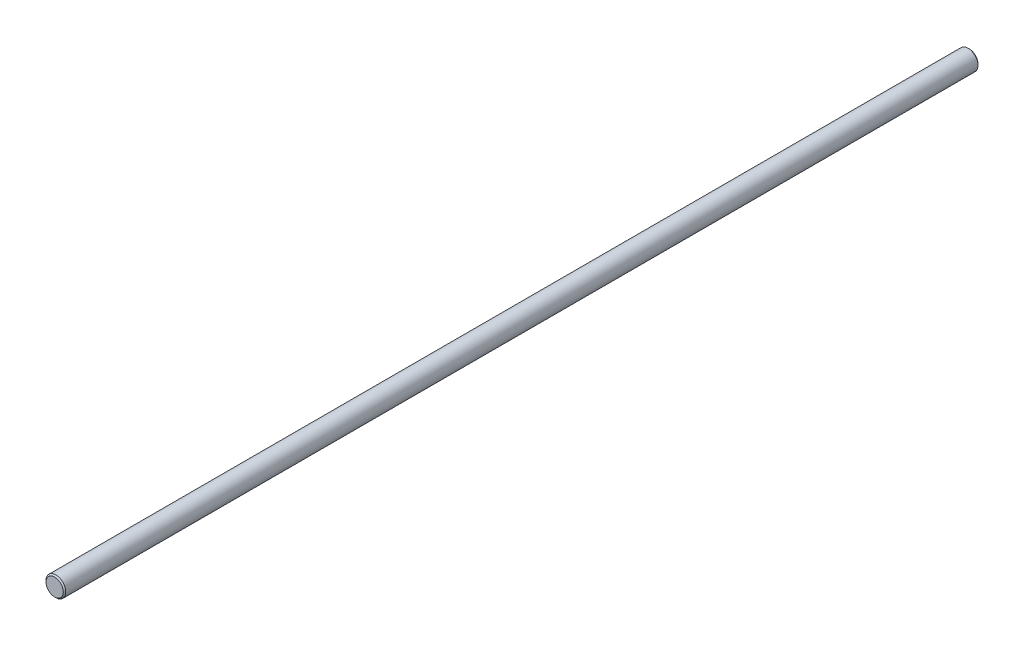
ISO-10303-21;
HEADER;
FILE_DESCRIPTION(('STEP AP214'),'2;1');
FILE_NAME('part.step','',(''),(''),'','','');
FILE_SCHEMA(('AUTOMOTIVE_DESIGN { 1 0 10303 214 1 1 1 1 }'));
ENDSEC;
DATA;
#1=APPLICATION_CONTEXT('core data for automotive mechanical design processes');
#2=APPLICATION_PROTOCOL_DEFINITION('international standard','automotive_design',2000,#1);
#3=PRODUCT_CONTEXT('',#1,'mechanical');
#4=PRODUCT('Part','Part','',(#3));
#5=PRODUCT_RELATED_PRODUCT_CATEGORY('part','',(#4));
#6=PRODUCT_DEFINITION_FORMATION('','',#4);
#7=PRODUCT_DEFINITION_CONTEXT('part definition',#1,'design');
#8=PRODUCT_DEFINITION('design','',#6,#7);
#9=PRODUCT_DEFINITION_SHAPE('','',#8);
#10=(LENGTH_UNIT() NAMED_UNIT(*) SI_UNIT(.MILLI.,.METRE.));
#11=(NAMED_UNIT(*) PLANE_ANGLE_UNIT() SI_UNIT($,.RADIAN.));
#12=(NAMED_UNIT(*) SI_UNIT($,.STERADIAN.) SOLID_ANGLE_UNIT());
#13=UNCERTAINTY_MEASURE_WITH_UNIT(LENGTH_MEASURE(1.E-05),#10,'distance_accuracy_value','');
#14=(GEOMETRIC_REPRESENTATION_CONTEXT(3) GLOBAL_UNCERTAINTY_ASSIGNED_CONTEXT((#13)) GLOBAL_UNIT_ASSIGNED_CONTEXT((#10,
#11,#12)) REPRESENTATION_CONTEXT('',''));
#15=CARTESIAN_POINT('',(0.,0.,0.));
#16=DIRECTION('',(0.,0.,1.));
#17=DIRECTION('',(1.,0.,0.));
#18=AXIS2_PLACEMENT_3D('',#15,#16,#17);
#19=CARTESIAN_POINT('',(0.,0.,-370.));
#20=DIRECTION('',(0.,0.,1.));
#21=DIRECTION('',(1.,0.,0.));
#22=AXIS2_PLACEMENT_3D('',#19,#20,#21);
#23=CYLINDRICAL_SURFACE('',#22,4.);
#24=CARTESIAN_POINT('',(0.,0.,-369.5));
#25=DIRECTION('',(0.,0.,1.));
#26=DIRECTION('',(1.,0.,0.));
#27=AXIS2_PLACEMENT_3D('',#24,#25,#26);
#28=CIRCLE('',#27,4.);
#29=CARTESIAN_POINT('',(4.,0.,-369.5));
#30=VERTEX_POINT('',#29);
#31=EDGE_CURVE('E43',#30,#30,#28,.T.);
#32=ORIENTED_EDGE('',*,*,#31,.T.);
#33=EDGE_LOOP('',(#32));
#34=FACE_BOUND('',#33,.T.);
#35=CARTESIAN_POINT('',(0.,0.,-0.5));
#36=DIRECTION('',(0.,0.,1.));
#37=DIRECTION('',(1.,0.,0.));
#38=AXIS2_PLACEMENT_3D('',#35,#36,#37);
#39=CIRCLE('',#38,4.);
#40=CARTESIAN_POINT('',(4.,0.,-0.5));
#41=VERTEX_POINT('',#40);
#42=EDGE_CURVE('E47',#41,#41,#39,.F.);
#43=ORIENTED_EDGE('',*,*,#42,.T.);
#44=EDGE_LOOP('',(#43));
#45=FACE_BOUND('',#44,.T.);
#46=ADVANCED_FACE('F32',(#34,#45),#23,.T.);
#47=CARTESIAN_POINT('',(0.,0.,-370.));
#48=DIRECTION('',(0.,0.,1.));
#49=DIRECTION('',(1.,0.,0.));
#50=AXIS2_PLACEMENT_3D('',#47,#48,#49);
#51=PLANE('',#50);
#52=CARTESIAN_POINT('',(0.,0.,-370.));
#53=DIRECTION('',(0.,0.,1.));
#54=DIRECTION('',(1.,0.,0.));
#55=AXIS2_PLACEMENT_3D('',#52,#53,#54);
#56=CIRCLE('',#55,3.5);
#57=CARTESIAN_POINT('',(3.5,0.,-370.));
#58=VERTEX_POINT('',#57);
#59=EDGE_CURVE('E39',#58,#58,#56,.F.);
#60=ORIENTED_EDGE('',*,*,#59,.T.);
#61=EDGE_LOOP('',(#60));
#62=FACE_BOUND('',#61,.T.);
#63=ADVANCED_FACE('F63',(#62),#51,.F.);
#64=CARTESIAN_POINT('',(0.,0.,0.));
#65=DIRECTION('',(0.,0.,1.));
#66=DIRECTION('',(1.,0.,0.));
#67=AXIS2_PLACEMENT_3D('',#64,#65,#66);
#68=PLANE('',#67);
#69=CARTESIAN_POINT('',(0.,0.,0.));
#70=DIRECTION('',(0.,0.,1.));
#71=DIRECTION('',(1.,0.,0.));
#72=AXIS2_PLACEMENT_3D('',#69,#70,#71);
#73=CIRCLE('',#72,3.5);
#74=CARTESIAN_POINT('',(3.5,0.,0.));
#75=VERTEX_POINT('',#74);
#76=EDGE_CURVE('E10',#75,#75,#73,.T.);
#77=ORIENTED_EDGE('',*,*,#76,.T.);
#78=EDGE_LOOP('',(#77));
#79=FACE_BOUND('',#78,.T.);
#80=ADVANCED_FACE('F60',(#79),#68,.T.);
#81=CARTESIAN_POINT('',(0.,0.,-369.5));
#82=DIRECTION('',(0.,0.,1.));
#83=DIRECTION('',(1.,0.,0.));
#84=AXIS2_PLACEMENT_3D('',#81,#82,#83);
#85=CONICAL_SURFACE('',#84,4.,0.785398163397445);
#86=ORIENTED_EDGE('',*,*,#59,.F.);
#87=EDGE_LOOP('',(#86));
#88=FACE_BOUND('',#87,.T.);
#89=ORIENTED_EDGE('',*,*,#31,.F.);
#90=EDGE_LOOP('',(#89));
#91=FACE_BOUND('',#90,.T.);
#92=ADVANCED_FACE('F56',(#88,#91),#85,.T.);
#93=CARTESIAN_POINT('',(0.,0.,0.));
#94=DIRECTION('',(0.,0.,-1.));
#95=DIRECTION('',(-1.,0.,0.));
#96=AXIS2_PLACEMENT_3D('',#93,#94,#95);
#97=CONICAL_SURFACE('',#96,3.5,0.785398163397445);
#98=ORIENTED_EDGE('',*,*,#42,.F.);
#99=EDGE_LOOP('',(#98));
#100=FACE_BOUND('',#99,.T.);
#101=ORIENTED_EDGE('',*,*,#76,.F.);
#102=EDGE_LOOP('',(#101));
#103=FACE_BOUND('',#102,.T.);
#104=ADVANCED_FACE('F34',(#100,#103),#97,.T.);
#105=CLOSED_SHELL('',(#46,#63,#80,#92,#104));
#106=MANIFOLD_SOLID_BREP('B2',#105);
#107=ADVANCED_BREP_SHAPE_REPRESENTATION('',(#18,#106),#14);
#108=SHAPE_DEFINITION_REPRESENTATION(#9,#107);
ENDSEC;
END-ISO-10303-21;
